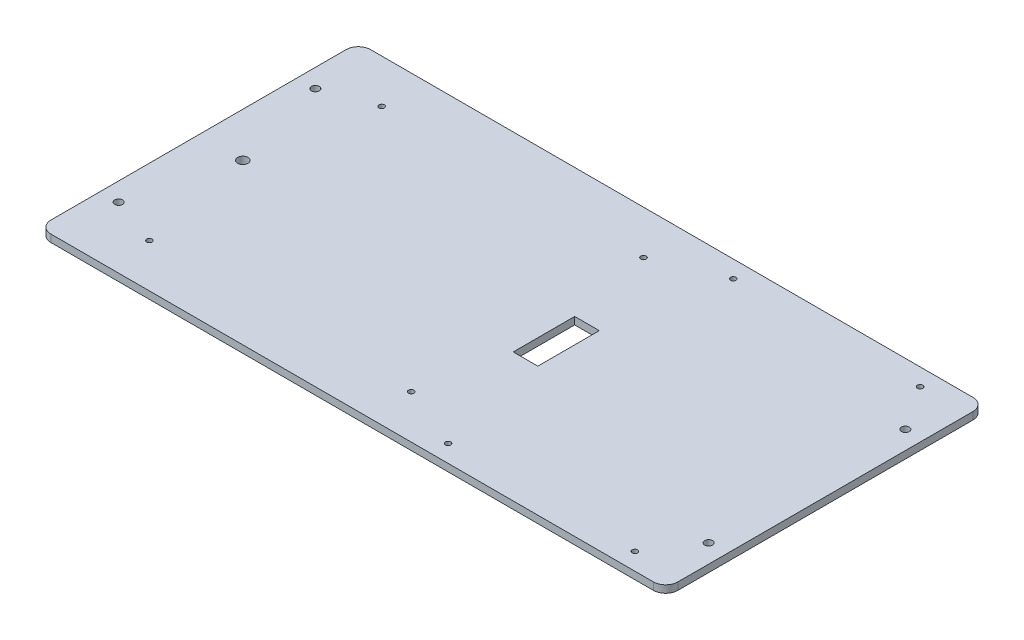
ISO-10303-21;
HEADER;
FILE_DESCRIPTION(('STEP AP214'),'2;1');
FILE_NAME('part.step','',(''),(''),'','','');
FILE_SCHEMA(('AUTOMOTIVE_DESIGN { 1 0 10303 214 1 1 1 1 }'));
ENDSEC;
DATA;
#1=APPLICATION_CONTEXT('core data for automotive mechanical design processes');
#2=APPLICATION_PROTOCOL_DEFINITION('international standard','automotive_design',2000,#1);
#3=PRODUCT_CONTEXT('',#1,'mechanical');
#4=PRODUCT('Part','Part','',(#3));
#5=PRODUCT_RELATED_PRODUCT_CATEGORY('part','',(#4));
#6=PRODUCT_DEFINITION_FORMATION('','',#4);
#7=PRODUCT_DEFINITION_CONTEXT('part definition',#1,'design');
#8=PRODUCT_DEFINITION('design','',#6,#7);
#9=PRODUCT_DEFINITION_SHAPE('','',#8);
#10=(LENGTH_UNIT() NAMED_UNIT(*) SI_UNIT(.MILLI.,.METRE.));
#11=(NAMED_UNIT(*) PLANE_ANGLE_UNIT() SI_UNIT($,.RADIAN.));
#12=(NAMED_UNIT(*) SI_UNIT($,.STERADIAN.) SOLID_ANGLE_UNIT());
#13=UNCERTAINTY_MEASURE_WITH_UNIT(LENGTH_MEASURE(1.E-05),#10,'distance_accuracy_value','');
#14=(GEOMETRIC_REPRESENTATION_CONTEXT(3) GLOBAL_UNCERTAINTY_ASSIGNED_CONTEXT((#13)) GLOBAL_UNIT_ASSIGNED_CONTEXT((#10,
#11,#12)) REPRESENTATION_CONTEXT('',''));
#15=CARTESIAN_POINT('',(0.,0.,0.));
#16=DIRECTION('',(0.,0.,1.));
#17=DIRECTION('',(1.,0.,0.));
#18=AXIS2_PLACEMENT_3D('',#15,#16,#17);
#19=CARTESIAN_POINT('',(0.,3.,0.));
#20=DIRECTION('',(0.,-1.,0.));
#21=DIRECTION('',(0.,0.,-1.));
#22=AXIS2_PLACEMENT_3D('',#19,#20,#21);
#23=PLANE('',#22);
#24=CARTESIAN_POINT('',(-120.,3.,-39.9999999999999));
#25=DIRECTION('',(0.,1.,0.));
#26=DIRECTION('',(0.,0.,1.));
#27=AXIS2_PLACEMENT_3D('',#24,#25,#26);
#28=CIRCLE('',#27,1.60000000000001);
#29=CARTESIAN_POINT('',(-120.,3.,-38.3999999999999));
#30=VERTEX_POINT('',#29);
#31=EDGE_CURVE('E166',#30,#30,#28,.T.);
#32=ORIENTED_EDGE('',*,*,#31,.F.);
#33=EDGE_LOOP('',(#32));
#34=FACE_BOUND('',#33,.T.);
#35=CARTESIAN_POINT('',(120.,3.,-40.));
#36=DIRECTION('',(0.,1.,0.));
#37=DIRECTION('',(0.,0.,-1.));
#38=AXIS2_PLACEMENT_3D('',#35,#36,#37);
#39=CIRCLE('',#38,1.60000000000001);
#40=CARTESIAN_POINT('',(120.,3.,-41.6));
#41=VERTEX_POINT('',#40);
#42=EDGE_CURVE('E172',#41,#41,#39,.T.);
#43=ORIENTED_EDGE('',*,*,#42,.F.);
#44=EDGE_LOOP('',(#43));
#45=FACE_BOUND('',#44,.T.);
#46=CARTESIAN_POINT('',(-120.,3.,40.));
#47=DIRECTION('',(0.,1.,0.));
#48=DIRECTION('',(0.,0.,-1.));
#49=AXIS2_PLACEMENT_3D('',#46,#47,#48);
#50=CIRCLE('',#49,1.60000000000001);
#51=CARTESIAN_POINT('',(-120.,3.,38.4));
#52=VERTEX_POINT('',#51);
#53=EDGE_CURVE('E178',#52,#52,#50,.T.);
#54=ORIENTED_EDGE('',*,*,#53,.F.);
#55=EDGE_LOOP('',(#54));
#56=FACE_BOUND('',#55,.T.);
#57=CARTESIAN_POINT('',(-100.25,3.,-47.25));
#58=DIRECTION('',(0.,1.,0.));
#59=DIRECTION('',(0.,0.,1.));
#60=AXIS2_PLACEMENT_3D('',#57,#58,#59);
#61=CIRCLE('',#60,1.10000000000001);
#62=CARTESIAN_POINT('',(-100.25,3.,-46.15));
#63=VERTEX_POINT('',#62);
#64=EDGE_CURVE('E184',#63,#63,#61,.T.);
#65=ORIENTED_EDGE('',*,*,#64,.F.);
#66=EDGE_LOOP('',(#65));
#67=FACE_BOUND('',#66,.T.);
#68=CARTESIAN_POINT('',(120.,3.,40.));
#69=DIRECTION('',(0.,1.,0.));
#70=DIRECTION('',(0.,0.,1.));
#71=AXIS2_PLACEMENT_3D('',#68,#69,#70);
#72=CIRCLE('',#71,1.60000000000001);
#73=CARTESIAN_POINT('',(120.,3.,41.6));
#74=VERTEX_POINT('',#73);
#75=EDGE_CURVE('E190',#74,#74,#72,.T.);
#76=ORIENTED_EDGE('',*,*,#75,.F.);
#77=EDGE_LOOP('',(#76));
#78=FACE_BOUND('',#77,.T.);
#79=DIRECTION('',(-1.,0.,0.));
#80=VECTOR('',#79,1.);
#81=CARTESIAN_POINT('',(-127.5,3.,-65.));
#82=LINE('',#81,#80);
#83=CARTESIAN_POINT('',(122.5,3.,-65.));
#84=VERTEX_POINT('',#83);
#85=CARTESIAN_POINT('',(-122.5,3.,-65.));
#86=VERTEX_POINT('',#85);
#87=EDGE_CURVE('E199',#84,#86,#82,.T.);
#88=ORIENTED_EDGE('',*,*,#87,.T.);
#89=CARTESIAN_POINT('',(-122.5,3.,-60.));
#90=DIRECTION('',(0.,-1.,0.));
#91=DIRECTION('',(0.,0.,-1.));
#92=AXIS2_PLACEMENT_3D('',#89,#90,#91);
#93=CIRCLE('',#92,5.);
#94=CARTESIAN_POINT('',(-127.5,3.,-60.));
#95=VERTEX_POINT('',#94);
#96=EDGE_CURVE('E239',#86,#95,#93,.F.);
#97=ORIENTED_EDGE('',*,*,#96,.T.);
#98=DIRECTION('',(0.,0.,1.));
#99=VECTOR('',#98,1.);
#100=CARTESIAN_POINT('',(-127.5,3.,65.));
#101=LINE('',#100,#99);
#102=CARTESIAN_POINT('',(-127.5,3.,60.));
#103=VERTEX_POINT('',#102);
#104=EDGE_CURVE('E203',#95,#103,#101,.T.);
#105=ORIENTED_EDGE('',*,*,#104,.T.);
#106=CARTESIAN_POINT('',(-122.5,3.,60.));
#107=DIRECTION('',(0.,-1.,0.));
#108=DIRECTION('',(0.,0.,-1.));
#109=AXIS2_PLACEMENT_3D('',#106,#107,#108);
#110=CIRCLE('',#109,5.);
#111=CARTESIAN_POINT('',(-122.5,3.,65.));
#112=VERTEX_POINT('',#111);
#113=EDGE_CURVE('E52',#103,#112,#110,.F.);
#114=ORIENTED_EDGE('',*,*,#113,.T.);
#115=DIRECTION('',(1.,0.,0.));
#116=VECTOR('',#115,1.);
#117=CARTESIAN_POINT('',(-127.5,3.,65.));
#118=LINE('',#117,#116);
#119=CARTESIAN_POINT('',(122.5,3.,65.));
#120=VERTEX_POINT('',#119);
#121=EDGE_CURVE('E205',#112,#120,#118,.T.);
#122=ORIENTED_EDGE('',*,*,#121,.T.);
#123=CARTESIAN_POINT('',(122.5,3.,60.));
#124=DIRECTION('',(0.,-1.,0.));
#125=DIRECTION('',(0.,0.,-1.));
#126=AXIS2_PLACEMENT_3D('',#123,#124,#125);
#127=CIRCLE('',#126,5.);
#128=CARTESIAN_POINT('',(127.5,3.,60.));
#129=VERTEX_POINT('',#128);
#130=EDGE_CURVE('E235',#120,#129,#127,.F.);
#131=ORIENTED_EDGE('',*,*,#130,.T.);
#132=DIRECTION('',(0.,0.,-1.));
#133=VECTOR('',#132,1.);
#134=CARTESIAN_POINT('',(127.5,3.,65.));
#135=LINE('',#134,#133);
#136=CARTESIAN_POINT('',(127.5,3.,-60.));
#137=VERTEX_POINT('',#136);
#138=EDGE_CURVE('E196',#129,#137,#135,.T.);
#139=ORIENTED_EDGE('',*,*,#138,.T.);
#140=CARTESIAN_POINT('',(122.5,3.,-60.));
#141=DIRECTION('',(0.,-1.,0.));
#142=DIRECTION('',(0.,0.,-1.));
#143=AXIS2_PLACEMENT_3D('',#140,#141,#142);
#144=CIRCLE('',#143,5.);
#145=EDGE_CURVE('E237',#137,#84,#144,.F.);
#146=ORIENTED_EDGE('',*,*,#145,.T.);
#147=EDGE_LOOP('',(#88,#97,#105,#114,#122,#131,#139,#146));
#148=FACE_BOUND('',#147,.T.);
#149=DIRECTION('',(0.,0.,-1.));
#150=VECTOR('',#149,1.);
#151=CARTESIAN_POINT('',(23.,3.,12.5));
#152=LINE('',#151,#150);
#153=CARTESIAN_POINT('',(23.,3.,12.5));
#154=VERTEX_POINT('',#153);
#155=CARTESIAN_POINT('',(23.,3.,-12.5));
#156=VERTEX_POINT('',#155);
#157=EDGE_CURVE('E122',#154,#156,#152,.T.);
#158=ORIENTED_EDGE('',*,*,#157,.F.);
#159=DIRECTION('',(1.,0.,0.));
#160=VECTOR('',#159,1.);
#161=CARTESIAN_POINT('',(13.,3.,12.5));
#162=LINE('',#161,#160);
#163=CARTESIAN_POINT('',(13.,3.,12.5));
#164=VERTEX_POINT('',#163);
#165=EDGE_CURVE('E148',#164,#154,#162,.T.);
#166=ORIENTED_EDGE('',*,*,#165,.F.);
#167=DIRECTION('',(0.,0.,1.));
#168=VECTOR('',#167,1.);
#169=CARTESIAN_POINT('',(13.,3.,12.5));
#170=LINE('',#169,#168);
#171=CARTESIAN_POINT('',(13.,3.,-12.5));
#172=VERTEX_POINT('',#171);
#173=EDGE_CURVE('E146',#172,#164,#170,.T.);
#174=ORIENTED_EDGE('',*,*,#173,.F.);
#175=DIRECTION('',(-1.,0.,0.));
#176=VECTOR('',#175,1.);
#177=CARTESIAN_POINT('',(13.,3.,-12.5));
#178=LINE('',#177,#176);
#179=EDGE_CURVE('E132',#156,#172,#178,.T.);
#180=ORIENTED_EDGE('',*,*,#179,.F.);
#181=EDGE_LOOP('',(#158,#166,#174,#180));
#182=FACE_BOUND('',#181,.T.);
#183=CARTESIAN_POINT('',(32.,3.,58.));
#184=DIRECTION('',(0.,1.,0.));
#185=DIRECTION('',(0.,0.,1.));
#186=AXIS2_PLACEMENT_3D('',#183,#184,#185);
#187=CIRCLE('',#186,1.09999999999999);
#188=CARTESIAN_POINT('',(32.,3.,59.1));
#189=VERTEX_POINT('',#188);
#190=EDGE_CURVE('E155',#189,#189,#187,.T.);
#191=ORIENTED_EDGE('',*,*,#190,.F.);
#192=EDGE_LOOP('',(#191));
#193=FACE_BOUND('',#192,.T.);
#194=CARTESIAN_POINT('',(108.,3.,58.));
#195=DIRECTION('',(0.,1.,0.));
#196=DIRECTION('',(0.,0.,1.));
#197=AXIS2_PLACEMENT_3D('',#194,#195,#196);
#198=CIRCLE('',#197,1.10000000000001);
#199=CARTESIAN_POINT('',(108.,3.,59.1));
#200=VERTEX_POINT('',#199);
#201=EDGE_CURVE('E585',#200,#200,#198,.T.);
#202=ORIENTED_EDGE('',*,*,#201,.F.);
#203=EDGE_LOOP('',(#202));
#204=FACE_BOUND('',#203,.T.);
#205=CARTESIAN_POINT('',(108.,3.,-58.));
#206=DIRECTION('',(0.,1.,0.));
#207=DIRECTION('',(0.,0.,1.));
#208=AXIS2_PLACEMENT_3D('',#205,#206,#207);
#209=CIRCLE('',#208,1.10000000000001);
#210=CARTESIAN_POINT('',(108.,3.,-56.9));
#211=VERTEX_POINT('',#210);
#212=EDGE_CURVE('E580',#211,#211,#209,.T.);
#213=ORIENTED_EDGE('',*,*,#212,.F.);
#214=EDGE_LOOP('',(#213));
#215=FACE_BOUND('',#214,.T.);
#216=CARTESIAN_POINT('',(32.,3.,-58.));
#217=DIRECTION('',(0.,1.,0.));
#218=DIRECTION('',(0.,0.,1.));
#219=AXIS2_PLACEMENT_3D('',#216,#217,#218);
#220=CIRCLE('',#219,1.09999999999999);
#221=CARTESIAN_POINT('',(32.,3.,-56.9));
#222=VERTEX_POINT('',#221);
#223=EDGE_CURVE('E575',#222,#222,#220,.T.);
#224=ORIENTED_EDGE('',*,*,#223,.F.);
#225=EDGE_LOOP('',(#224));
#226=FACE_BOUND('',#225,.T.);
#227=CARTESIAN_POINT('',(6.24999999999997,3.,-47.25));
#228=DIRECTION('',(0.,1.,0.));
#229=DIRECTION('',(0.,0.,1.));
#230=AXIS2_PLACEMENT_3D('',#227,#228,#229);
#231=CIRCLE('',#230,1.09999999999999);
#232=CARTESIAN_POINT('',(6.24999999999997,3.,-46.15));
#233=VERTEX_POINT('',#232);
#234=EDGE_CURVE('E570',#233,#233,#231,.T.);
#235=ORIENTED_EDGE('',*,*,#234,.F.);
#236=EDGE_LOOP('',(#235));
#237=FACE_BOUND('',#236,.T.);
#238=CARTESIAN_POINT('',(-100.25,3.,47.25));
#239=DIRECTION('',(0.,1.,0.));
#240=DIRECTION('',(0.,0.,1.));
#241=AXIS2_PLACEMENT_3D('',#238,#239,#240);
#242=CIRCLE('',#241,1.10000000000001);
#243=CARTESIAN_POINT('',(-100.25,3.,48.35));
#244=VERTEX_POINT('',#243);
#245=EDGE_CURVE('E565',#244,#244,#242,.T.);
#246=ORIENTED_EDGE('',*,*,#245,.F.);
#247=EDGE_LOOP('',(#246));
#248=FACE_BOUND('',#247,.T.);
#249=CARTESIAN_POINT('',(6.24999999999997,3.,47.25));
#250=DIRECTION('',(0.,1.,0.));
#251=DIRECTION('',(0.,0.,1.));
#252=AXIS2_PLACEMENT_3D('',#249,#250,#251);
#253=CIRCLE('',#252,1.09999999999999);
#254=CARTESIAN_POINT('',(6.24999999999997,3.,48.35));
#255=VERTEX_POINT('',#254);
#256=EDGE_CURVE('E560',#255,#255,#253,.T.);
#257=ORIENTED_EDGE('',*,*,#256,.F.);
#258=EDGE_LOOP('',(#257));
#259=FACE_BOUND('',#258,.T.);
#260=CARTESIAN_POINT('',(-109.5,3.,0.));
#261=DIRECTION('',(0.,1.,0.));
#262=DIRECTION('',(0.,0.,1.));
#263=AXIS2_PLACEMENT_3D('',#260,#261,#262);
#264=CIRCLE('',#263,2.1);
#265=CARTESIAN_POINT('',(-109.5,3.,2.10000000000003));
#266=VERTEX_POINT('',#265);
#267=EDGE_CURVE('E554',#266,#266,#264,.T.);
#268=ORIENTED_EDGE('',*,*,#267,.F.);
#269=EDGE_LOOP('',(#268));
#270=FACE_BOUND('',#269,.T.);
#271=ADVANCED_FACE('F32',(#34,#45,#56,#67,#78,#148,#182,#193,#204,#215,#226,#237,#248,#259,
#270),#23,.F.);
#272=CARTESIAN_POINT('',(0.,0.,0.));
#273=DIRECTION('',(0.,-1.,0.));
#274=DIRECTION('',(0.,0.,-1.));
#275=AXIS2_PLACEMENT_3D('',#272,#273,#274);
#276=PLANE('',#275);
#277=CARTESIAN_POINT('',(6.24999999999997,0.,47.25));
#278=DIRECTION('',(0.,1.,0.));
#279=DIRECTION('',(0.,0.,1.));
#280=AXIS2_PLACEMENT_3D('',#277,#278,#279);
#281=CIRCLE('',#280,1.09999999999999);
#282=CARTESIAN_POINT('',(6.24999999999997,0.,48.35));
#283=VERTEX_POINT('',#282);
#284=EDGE_CURVE('E557',#283,#283,#281,.T.);
#285=ORIENTED_EDGE('',*,*,#284,.T.);
#286=EDGE_LOOP('',(#285));
#287=FACE_BOUND('',#286,.T.);
#288=CARTESIAN_POINT('',(6.24999999999997,0.,-47.25));
#289=DIRECTION('',(0.,1.,0.));
#290=DIRECTION('',(0.,0.,1.));
#291=AXIS2_PLACEMENT_3D('',#288,#289,#290);
#292=CIRCLE('',#291,1.09999999999999);
#293=CARTESIAN_POINT('',(6.24999999999997,0.,-46.15));
#294=VERTEX_POINT('',#293);
#295=EDGE_CURVE('E568',#294,#294,#292,.T.);
#296=ORIENTED_EDGE('',*,*,#295,.T.);
#297=EDGE_LOOP('',(#296));
#298=FACE_BOUND('',#297,.T.);
#299=CARTESIAN_POINT('',(108.,0.,-58.));
#300=DIRECTION('',(0.,1.,0.));
#301=DIRECTION('',(0.,0.,1.));
#302=AXIS2_PLACEMENT_3D('',#299,#300,#301);
#303=CIRCLE('',#302,1.10000000000001);
#304=CARTESIAN_POINT('',(108.,0.,-56.9));
#305=VERTEX_POINT('',#304);
#306=EDGE_CURVE('E578',#305,#305,#303,.T.);
#307=ORIENTED_EDGE('',*,*,#306,.T.);
#308=EDGE_LOOP('',(#307));
#309=FACE_BOUND('',#308,.T.);
#310=CARTESIAN_POINT('',(32.,0.,58.));
#311=DIRECTION('',(0.,1.,0.));
#312=DIRECTION('',(0.,0.,1.));
#313=AXIS2_PLACEMENT_3D('',#310,#311,#312);
#314=CIRCLE('',#313,1.09999999999999);
#315=CARTESIAN_POINT('',(32.,0.,59.1));
#316=VERTEX_POINT('',#315);
#317=EDGE_CURVE('E588',#316,#316,#314,.T.);
#318=ORIENTED_EDGE('',*,*,#317,.T.);
#319=EDGE_LOOP('',(#318));
#320=FACE_BOUND('',#319,.T.);
#321=CARTESIAN_POINT('',(120.,0.,-40.));
#322=DIRECTION('',(0.,1.,0.));
#323=DIRECTION('',(0.,0.,-1.));
#324=AXIS2_PLACEMENT_3D('',#321,#322,#323);
#325=CIRCLE('',#324,1.60000000000001);
#326=CARTESIAN_POINT('',(120.,0.,-41.6));
#327=VERTEX_POINT('',#326);
#328=EDGE_CURVE('E169',#327,#327,#325,.T.);
#329=ORIENTED_EDGE('',*,*,#328,.T.);
#330=EDGE_LOOP('',(#329));
#331=FACE_BOUND('',#330,.T.);
#332=CARTESIAN_POINT('',(-100.25,0.,-47.25));
#333=DIRECTION('',(0.,1.,0.));
#334=DIRECTION('',(0.,0.,1.));
#335=AXIS2_PLACEMENT_3D('',#332,#333,#334);
#336=CIRCLE('',#335,1.10000000000001);
#337=CARTESIAN_POINT('',(-100.25,0.,-46.15));
#338=VERTEX_POINT('',#337);
#339=EDGE_CURVE('E181',#338,#338,#336,.T.);
#340=ORIENTED_EDGE('',*,*,#339,.T.);
#341=EDGE_LOOP('',(#340));
#342=FACE_BOUND('',#341,.T.);
#343=DIRECTION('',(0.,0.,1.));
#344=VECTOR('',#343,1.);
#345=CARTESIAN_POINT('',(-127.5,0.,65.));
#346=LINE('',#345,#344);
#347=CARTESIAN_POINT('',(-127.5,0.,-60.));
#348=VERTEX_POINT('',#347);
#349=CARTESIAN_POINT('',(-127.5,0.,60.));
#350=VERTEX_POINT('',#349);
#351=EDGE_CURVE('E213',#348,#350,#346,.T.);
#352=ORIENTED_EDGE('',*,*,#351,.F.);
#353=CARTESIAN_POINT('',(-122.5,0.,-60.));
#354=DIRECTION('',(0.,-1.,0.));
#355=DIRECTION('',(0.,0.,-1.));
#356=AXIS2_PLACEMENT_3D('',#353,#354,#355);
#357=CIRCLE('',#356,5.);
#358=CARTESIAN_POINT('',(-122.5,0.,-65.));
#359=VERTEX_POINT('',#358);
#360=EDGE_CURVE('E227',#348,#359,#357,.T.);
#361=ORIENTED_EDGE('',*,*,#360,.T.);
#362=DIRECTION('',(-1.,0.,0.));
#363=VECTOR('',#362,1.);
#364=CARTESIAN_POINT('',(-127.5,0.,-65.));
#365=LINE('',#364,#363);
#366=CARTESIAN_POINT('',(122.5,0.,-65.));
#367=VERTEX_POINT('',#366);
#368=EDGE_CURVE('E210',#367,#359,#365,.T.);
#369=ORIENTED_EDGE('',*,*,#368,.F.);
#370=CARTESIAN_POINT('',(122.5,0.,-60.));
#371=DIRECTION('',(0.,-1.,0.));
#372=DIRECTION('',(0.,0.,-1.));
#373=AXIS2_PLACEMENT_3D('',#370,#371,#372);
#374=CIRCLE('',#373,5.);
#375=CARTESIAN_POINT('',(127.5,0.,-60.));
#376=VERTEX_POINT('',#375);
#377=EDGE_CURVE('E225',#367,#376,#374,.T.);
#378=ORIENTED_EDGE('',*,*,#377,.T.);
#379=DIRECTION('',(0.,0.,-1.));
#380=VECTOR('',#379,1.);
#381=CARTESIAN_POINT('',(127.5,0.,65.));
#382=LINE('',#381,#380);
#383=CARTESIAN_POINT('',(127.5,0.,60.));
#384=VERTEX_POINT('',#383);
#385=EDGE_CURVE('E193',#384,#376,#382,.T.);
#386=ORIENTED_EDGE('',*,*,#385,.F.);
#387=CARTESIAN_POINT('',(122.5,0.,60.));
#388=DIRECTION('',(0.,-1.,0.));
#389=DIRECTION('',(0.,0.,-1.));
#390=AXIS2_PLACEMENT_3D('',#387,#388,#389);
#391=CIRCLE('',#390,5.);
#392=CARTESIAN_POINT('',(122.5,0.,65.));
#393=VERTEX_POINT('',#392);
#394=EDGE_CURVE('E223',#384,#393,#391,.T.);
#395=ORIENTED_EDGE('',*,*,#394,.T.);
#396=DIRECTION('',(1.,0.,0.));
#397=VECTOR('',#396,1.);
#398=CARTESIAN_POINT('',(-127.5,0.,65.));
#399=LINE('',#398,#397);
#400=CARTESIAN_POINT('',(-122.5,0.,65.));
#401=VERTEX_POINT('',#400);
#402=EDGE_CURVE('E200',#401,#393,#399,.T.);
#403=ORIENTED_EDGE('',*,*,#402,.F.);
#404=CARTESIAN_POINT('',(-122.5,0.,60.));
#405=DIRECTION('',(0.,-1.,0.));
#406=DIRECTION('',(0.,0.,-1.));
#407=AXIS2_PLACEMENT_3D('',#404,#405,#406);
#408=CIRCLE('',#407,5.);
#409=EDGE_CURVE('E221',#401,#350,#408,.T.);
#410=ORIENTED_EDGE('',*,*,#409,.T.);
#411=EDGE_LOOP('',(#352,#361,#369,#378,#386,#395,#403,#410));
#412=FACE_BOUND('',#411,.T.);
#413=CARTESIAN_POINT('',(120.,0.,40.));
#414=DIRECTION('',(0.,1.,0.));
#415=DIRECTION('',(0.,0.,1.));
#416=AXIS2_PLACEMENT_3D('',#413,#414,#415);
#417=CIRCLE('',#416,1.60000000000001);
#418=CARTESIAN_POINT('',(120.,0.,41.6));
#419=VERTEX_POINT('',#418);
#420=EDGE_CURVE('E187',#419,#419,#417,.T.);
#421=ORIENTED_EDGE('',*,*,#420,.T.);
#422=EDGE_LOOP('',(#421));
#423=FACE_BOUND('',#422,.T.);
#424=CARTESIAN_POINT('',(-120.,0.,40.));
#425=DIRECTION('',(0.,1.,0.));
#426=DIRECTION('',(0.,0.,-1.));
#427=AXIS2_PLACEMENT_3D('',#424,#425,#426);
#428=CIRCLE('',#427,1.60000000000001);
#429=CARTESIAN_POINT('',(-120.,0.,38.4));
#430=VERTEX_POINT('',#429);
#431=EDGE_CURVE('E175',#430,#430,#428,.T.);
#432=ORIENTED_EDGE('',*,*,#431,.T.);
#433=EDGE_LOOP('',(#432));
#434=FACE_BOUND('',#433,.T.);
#435=CARTESIAN_POINT('',(-120.,0.,-39.9999999999999));
#436=DIRECTION('',(0.,1.,0.));
#437=DIRECTION('',(0.,0.,1.));
#438=AXIS2_PLACEMENT_3D('',#435,#436,#437);
#439=CIRCLE('',#438,1.60000000000001);
#440=CARTESIAN_POINT('',(-120.,0.,-38.3999999999999));
#441=VERTEX_POINT('',#440);
#442=EDGE_CURVE('E140',#441,#441,#439,.T.);
#443=ORIENTED_EDGE('',*,*,#442,.T.);
#444=EDGE_LOOP('',(#443));
#445=FACE_BOUND('',#444,.T.);
#446=DIRECTION('',(1.,0.,0.));
#447=VECTOR('',#446,1.);
#448=CARTESIAN_POINT('',(13.,0.,12.5));
#449=LINE('',#448,#447);
#450=CARTESIAN_POINT('',(13.,0.,12.5));
#451=VERTEX_POINT('',#450);
#452=CARTESIAN_POINT('',(23.,0.,12.5));
#453=VERTEX_POINT('',#452);
#454=EDGE_CURVE('E133',#451,#453,#449,.T.);
#455=ORIENTED_EDGE('',*,*,#454,.T.);
#456=DIRECTION('',(0.,0.,-1.));
#457=VECTOR('',#456,1.);
#458=CARTESIAN_POINT('',(23.,0.,12.5));
#459=LINE('',#458,#457);
#460=CARTESIAN_POINT('',(23.,0.,-12.5));
#461=VERTEX_POINT('',#460);
#462=EDGE_CURVE('E153',#453,#461,#459,.T.);
#463=ORIENTED_EDGE('',*,*,#462,.T.);
#464=DIRECTION('',(-1.,0.,0.));
#465=VECTOR('',#464,1.);
#466=CARTESIAN_POINT('',(13.,0.,-12.5));
#467=LINE('',#466,#465);
#468=CARTESIAN_POINT('',(13.,0.,-12.5));
#469=VERTEX_POINT('',#468);
#470=EDGE_CURVE('E139',#461,#469,#467,.T.);
#471=ORIENTED_EDGE('',*,*,#470,.T.);
#472=DIRECTION('',(0.,0.,1.));
#473=VECTOR('',#472,1.);
#474=CARTESIAN_POINT('',(13.,0.,12.5));
#475=LINE('',#474,#473);
#476=EDGE_CURVE('E157',#469,#451,#475,.T.);
#477=ORIENTED_EDGE('',*,*,#476,.T.);
#478=EDGE_LOOP('',(#455,#463,#471,#477));
#479=FACE_BOUND('',#478,.T.);
#480=CARTESIAN_POINT('',(108.,0.,58.));
#481=DIRECTION('',(0.,1.,0.));
#482=DIRECTION('',(0.,0.,1.));
#483=AXIS2_PLACEMENT_3D('',#480,#481,#482);
#484=CIRCLE('',#483,1.10000000000001);
#485=CARTESIAN_POINT('',(108.,0.,59.1));
#486=VERTEX_POINT('',#485);
#487=EDGE_CURVE('E541',#486,#486,#484,.T.);
#488=ORIENTED_EDGE('',*,*,#487,.T.);
#489=EDGE_LOOP('',(#488));
#490=FACE_BOUND('',#489,.T.);
#491=CARTESIAN_POINT('',(32.,0.,-58.));
#492=DIRECTION('',(0.,1.,0.));
#493=DIRECTION('',(0.,0.,1.));
#494=AXIS2_PLACEMENT_3D('',#491,#492,#493);
#495=CIRCLE('',#494,1.09999999999999);
#496=CARTESIAN_POINT('',(32.,0.,-56.9));
#497=VERTEX_POINT('',#496);
#498=EDGE_CURVE('E545',#497,#497,#495,.T.);
#499=ORIENTED_EDGE('',*,*,#498,.T.);
#500=EDGE_LOOP('',(#499));
#501=FACE_BOUND('',#500,.T.);
#502=CARTESIAN_POINT('',(-100.25,0.,47.25));
#503=DIRECTION('',(0.,1.,0.));
#504=DIRECTION('',(0.,0.,1.));
#505=AXIS2_PLACEMENT_3D('',#502,#503,#504);
#506=CIRCLE('',#505,1.10000000000001);
#507=CARTESIAN_POINT('',(-100.25,0.,48.35));
#508=VERTEX_POINT('',#507);
#509=EDGE_CURVE('E549',#508,#508,#506,.T.);
#510=ORIENTED_EDGE('',*,*,#509,.T.);
#511=EDGE_LOOP('',(#510));
#512=FACE_BOUND('',#511,.T.);
#513=CARTESIAN_POINT('',(-109.5,0.,0.));
#514=DIRECTION('',(0.,1.,0.));
#515=DIRECTION('',(0.,0.,1.));
#516=AXIS2_PLACEMENT_3D('',#513,#514,#515);
#517=CIRCLE('',#516,2.1);
#518=CARTESIAN_POINT('',(-109.5,0.,2.10000000000003));
#519=VERTEX_POINT('',#518);
#520=EDGE_CURVE('E552',#519,#519,#517,.T.);
#521=ORIENTED_EDGE('',*,*,#520,.T.);
#522=EDGE_LOOP('',(#521));
#523=FACE_BOUND('',#522,.T.);
#524=ADVANCED_FACE('F252',(#287,#298,#309,#320,#331,#342,#412,#423,#434,#445,#479,#490,#501,
#512,#523),#276,.T.);
#525=CARTESIAN_POINT('',(127.5,3.,65.));
#526=DIRECTION('',(-1.,0.,0.));
#527=DIRECTION('',(0.,0.,1.));
#528=AXIS2_PLACEMENT_3D('',#525,#526,#527);
#529=PLANE('',#528);
#530=ORIENTED_EDGE('',*,*,#385,.T.);
#531=DIRECTION('',(0.,-1.,0.));
#532=VECTOR('',#531,1.);
#533=CARTESIAN_POINT('',(127.5,3.,-60.));
#534=LINE('',#533,#532);
#535=EDGE_CURVE('E244',#376,#137,#534,.F.);
#536=ORIENTED_EDGE('',*,*,#535,.T.);
#537=ORIENTED_EDGE('',*,*,#138,.F.);
#538=DIRECTION('',(0.,-1.,0.));
#539=VECTOR('',#538,1.);
#540=CARTESIAN_POINT('',(127.5,3.,60.));
#541=LINE('',#540,#539);
#542=EDGE_CURVE('E241',#129,#384,#541,.T.);
#543=ORIENTED_EDGE('',*,*,#542,.T.);
#544=EDGE_LOOP('',(#530,#536,#537,#543));
#545=FACE_BOUND('',#544,.T.);
#546=ADVANCED_FACE('F261',(#545),#529,.F.);
#547=CARTESIAN_POINT('',(-127.5,3.,-65.));
#548=DIRECTION('',(0.,0.,1.));
#549=DIRECTION('',(1.,0.,0.));
#550=AXIS2_PLACEMENT_3D('',#547,#548,#549);
#551=PLANE('',#550);
#552=ORIENTED_EDGE('',*,*,#368,.T.);
#553=DIRECTION('',(0.,-1.,0.));
#554=VECTOR('',#553,1.);
#555=CARTESIAN_POINT('',(-122.5,3.,-65.));
#556=LINE('',#555,#554);
#557=EDGE_CURVE('E232',#359,#86,#556,.F.);
#558=ORIENTED_EDGE('',*,*,#557,.T.);
#559=ORIENTED_EDGE('',*,*,#87,.F.);
#560=DIRECTION('',(0.,-1.,0.));
#561=VECTOR('',#560,1.);
#562=CARTESIAN_POINT('',(122.5,3.,-65.));
#563=LINE('',#562,#561);
#564=EDGE_CURVE('E229',#84,#367,#563,.T.);
#565=ORIENTED_EDGE('',*,*,#564,.T.);
#566=EDGE_LOOP('',(#552,#558,#559,#565));
#567=FACE_BOUND('',#566,.T.);
#568=ADVANCED_FACE('F270',(#567),#551,.F.);
#569=CARTESIAN_POINT('',(-127.5,3.,65.));
#570=DIRECTION('',(1.,0.,0.));
#571=DIRECTION('',(0.,0.,-1.));
#572=AXIS2_PLACEMENT_3D('',#569,#570,#571);
#573=PLANE('',#572);
#574=ORIENTED_EDGE('',*,*,#104,.F.);
#575=DIRECTION('',(0.,-1.,0.));
#576=VECTOR('',#575,1.);
#577=CARTESIAN_POINT('',(-127.5,3.,-60.));
#578=LINE('',#577,#576);
#579=EDGE_CURVE('E218',#95,#348,#578,.T.);
#580=ORIENTED_EDGE('',*,*,#579,.T.);
#581=ORIENTED_EDGE('',*,*,#351,.T.);
#582=DIRECTION('',(0.,-1.,0.));
#583=VECTOR('',#582,1.);
#584=CARTESIAN_POINT('',(-127.5,3.,60.));
#585=LINE('',#584,#583);
#586=EDGE_CURVE('E207',#350,#103,#585,.F.);
#587=ORIENTED_EDGE('',*,*,#586,.T.);
#588=EDGE_LOOP('',(#574,#580,#581,#587));
#589=FACE_BOUND('',#588,.T.);
#590=ADVANCED_FACE('F278',(#589),#573,.F.);
#591=CARTESIAN_POINT('',(-127.5,3.,65.));
#592=DIRECTION('',(0.,0.,-1.));
#593=DIRECTION('',(-1.,0.,0.));
#594=AXIS2_PLACEMENT_3D('',#591,#592,#593);
#595=PLANE('',#594);
#596=ORIENTED_EDGE('',*,*,#402,.T.);
#597=DIRECTION('',(0.,-1.,0.));
#598=VECTOR('',#597,1.);
#599=CARTESIAN_POINT('',(122.5,3.,65.));
#600=LINE('',#599,#598);
#601=EDGE_CURVE('E11',#393,#120,#600,.F.);
#602=ORIENTED_EDGE('',*,*,#601,.T.);
#603=ORIENTED_EDGE('',*,*,#121,.F.);
#604=DIRECTION('',(0.,-1.,0.));
#605=VECTOR('',#604,1.);
#606=CARTESIAN_POINT('',(-122.5,3.,65.));
#607=LINE('',#606,#605);
#608=EDGE_CURVE('E40',#112,#401,#607,.T.);
#609=ORIENTED_EDGE('',*,*,#608,.T.);
#610=EDGE_LOOP('',(#596,#602,#603,#609));
#611=FACE_BOUND('',#610,.T.);
#612=ADVANCED_FACE('F248',(#611),#595,.F.);
#613=CARTESIAN_POINT('',(120.,3.,40.));
#614=DIRECTION('',(0.,-1.,0.));
#615=DIRECTION('',(0.,0.,-1.));
#616=AXIS2_PLACEMENT_3D('',#613,#614,#615);
#617=CYLINDRICAL_SURFACE('',#616,1.60000000000001);
#618=ORIENTED_EDGE('',*,*,#75,.T.);
#619=EDGE_LOOP('',(#618));
#620=FACE_BOUND('',#619,.T.);
#621=ORIENTED_EDGE('',*,*,#420,.F.);
#622=EDGE_LOOP('',(#621));
#623=FACE_BOUND('',#622,.T.);
#624=ADVANCED_FACE('F295',(#620,#623),#617,.F.);
#625=CARTESIAN_POINT('',(-100.25,3.,-47.25));
#626=DIRECTION('',(0.,-1.,0.));
#627=DIRECTION('',(0.,0.,-1.));
#628=AXIS2_PLACEMENT_3D('',#625,#626,#627);
#629=CYLINDRICAL_SURFACE('',#628,1.10000000000001);
#630=ORIENTED_EDGE('',*,*,#64,.T.);
#631=EDGE_LOOP('',(#630));
#632=FACE_BOUND('',#631,.T.);
#633=ORIENTED_EDGE('',*,*,#339,.F.);
#634=EDGE_LOOP('',(#633));
#635=FACE_BOUND('',#634,.T.);
#636=ADVANCED_FACE('F461',(#632,#635),#629,.F.);
#637=CARTESIAN_POINT('',(-120.,3.,40.));
#638=DIRECTION('',(0.,-1.,0.));
#639=DIRECTION('',(0.,0.,-1.));
#640=AXIS2_PLACEMENT_3D('',#637,#638,#639);
#641=CYLINDRICAL_SURFACE('',#640,1.60000000000001);
#642=ORIENTED_EDGE('',*,*,#53,.T.);
#643=EDGE_LOOP('',(#642));
#644=FACE_BOUND('',#643,.T.);
#645=ORIENTED_EDGE('',*,*,#431,.F.);
#646=EDGE_LOOP('',(#645));
#647=FACE_BOUND('',#646,.T.);
#648=ADVANCED_FACE('F452',(#644,#647),#641,.F.);
#649=CARTESIAN_POINT('',(120.,3.,-40.));
#650=DIRECTION('',(0.,-1.,0.));
#651=DIRECTION('',(0.,0.,-1.));
#652=AXIS2_PLACEMENT_3D('',#649,#650,#651);
#653=CYLINDRICAL_SURFACE('',#652,1.60000000000001);
#654=ORIENTED_EDGE('',*,*,#42,.T.);
#655=EDGE_LOOP('',(#654));
#656=FACE_BOUND('',#655,.T.);
#657=ORIENTED_EDGE('',*,*,#328,.F.);
#658=EDGE_LOOP('',(#657));
#659=FACE_BOUND('',#658,.T.);
#660=ADVANCED_FACE('F443',(#656,#659),#653,.F.);
#661=CARTESIAN_POINT('',(-120.,3.,-39.9999999999999));
#662=DIRECTION('',(0.,-1.,0.));
#663=DIRECTION('',(0.,0.,-1.));
#664=AXIS2_PLACEMENT_3D('',#661,#662,#663);
#665=CYLINDRICAL_SURFACE('',#664,1.60000000000001);
#666=ORIENTED_EDGE('',*,*,#31,.T.);
#667=EDGE_LOOP('',(#666));
#668=FACE_BOUND('',#667,.T.);
#669=ORIENTED_EDGE('',*,*,#442,.F.);
#670=EDGE_LOOP('',(#669));
#671=FACE_BOUND('',#670,.T.);
#672=ADVANCED_FACE('F435',(#668,#671),#665,.F.);
#673=CARTESIAN_POINT('',(23.,3.,12.5));
#674=DIRECTION('',(-1.,0.,0.));
#675=DIRECTION('',(0.,0.,1.));
#676=AXIS2_PLACEMENT_3D('',#673,#674,#675);
#677=PLANE('',#676);
#678=ORIENTED_EDGE('',*,*,#462,.F.);
#679=DIRECTION('',(0.,-1.,0.));
#680=VECTOR('',#679,1.);
#681=CARTESIAN_POINT('',(23.,3.,12.5));
#682=LINE('',#681,#680);
#683=EDGE_CURVE('E128',#154,#453,#682,.T.);
#684=ORIENTED_EDGE('',*,*,#683,.F.);
#685=ORIENTED_EDGE('',*,*,#157,.T.);
#686=DIRECTION('',(0.,-1.,0.));
#687=VECTOR('',#686,1.);
#688=CARTESIAN_POINT('',(23.,3.,-12.5));
#689=LINE('',#688,#687);
#690=EDGE_CURVE('E125',#156,#461,#689,.T.);
#691=ORIENTED_EDGE('',*,*,#690,.T.);
#692=EDGE_LOOP('',(#678,#684,#685,#691));
#693=FACE_BOUND('',#692,.T.);
#694=ADVANCED_FACE('F124',(#693),#677,.T.);
#695=CARTESIAN_POINT('',(13.,3.,-12.5));
#696=DIRECTION('',(0.,0.,1.));
#697=DIRECTION('',(1.,0.,0.));
#698=AXIS2_PLACEMENT_3D('',#695,#696,#697);
#699=PLANE('',#698);
#700=ORIENTED_EDGE('',*,*,#470,.F.);
#701=ORIENTED_EDGE('',*,*,#690,.F.);
#702=ORIENTED_EDGE('',*,*,#179,.T.);
#703=DIRECTION('',(0.,-1.,0.));
#704=VECTOR('',#703,1.);
#705=CARTESIAN_POINT('',(13.,3.,-12.5));
#706=LINE('',#705,#704);
#707=EDGE_CURVE('E141',#172,#469,#706,.T.);
#708=ORIENTED_EDGE('',*,*,#707,.T.);
#709=EDGE_LOOP('',(#700,#701,#702,#708));
#710=FACE_BOUND('',#709,.T.);
#711=ADVANCED_FACE('F136',(#710),#699,.T.);
#712=CARTESIAN_POINT('',(13.,3.,12.5));
#713=DIRECTION('',(1.,0.,0.));
#714=DIRECTION('',(0.,0.,-1.));
#715=AXIS2_PLACEMENT_3D('',#712,#713,#714);
#716=PLANE('',#715);
#717=ORIENTED_EDGE('',*,*,#476,.F.);
#718=ORIENTED_EDGE('',*,*,#707,.F.);
#719=ORIENTED_EDGE('',*,*,#173,.T.);
#720=DIRECTION('',(0.,-1.,0.));
#721=VECTOR('',#720,1.);
#722=CARTESIAN_POINT('',(13.,3.,12.5));
#723=LINE('',#722,#721);
#724=EDGE_CURVE('E163',#164,#451,#723,.T.);
#725=ORIENTED_EDGE('',*,*,#724,.T.);
#726=EDGE_LOOP('',(#717,#718,#719,#725));
#727=FACE_BOUND('',#726,.T.);
#728=ADVANCED_FACE('F411',(#727),#716,.T.);
#729=CARTESIAN_POINT('',(13.,3.,12.5));
#730=DIRECTION('',(0.,0.,-1.));
#731=DIRECTION('',(-1.,0.,0.));
#732=AXIS2_PLACEMENT_3D('',#729,#730,#731);
#733=PLANE('',#732);
#734=ORIENTED_EDGE('',*,*,#454,.F.);
#735=ORIENTED_EDGE('',*,*,#724,.F.);
#736=ORIENTED_EDGE('',*,*,#165,.T.);
#737=ORIENTED_EDGE('',*,*,#683,.T.);
#738=EDGE_LOOP('',(#734,#735,#736,#737));
#739=FACE_BOUND('',#738,.T.);
#740=ADVANCED_FACE('F402',(#739),#733,.T.);
#741=CARTESIAN_POINT('',(32.,3.,58.));
#742=DIRECTION('',(0.,-1.,0.));
#743=DIRECTION('',(0.,0.,-1.));
#744=AXIS2_PLACEMENT_3D('',#741,#742,#743);
#745=CYLINDRICAL_SURFACE('',#744,1.09999999999999);
#746=ORIENTED_EDGE('',*,*,#190,.T.);
#747=EDGE_LOOP('',(#746));
#748=FACE_BOUND('',#747,.T.);
#749=ORIENTED_EDGE('',*,*,#317,.F.);
#750=EDGE_LOOP('',(#749));
#751=FACE_BOUND('',#750,.T.);
#752=ADVANCED_FACE('F393',(#748,#751),#745,.F.);
#753=CARTESIAN_POINT('',(108.,3.,58.));
#754=DIRECTION('',(0.,-1.,0.));
#755=DIRECTION('',(0.,0.,-1.));
#756=AXIS2_PLACEMENT_3D('',#753,#754,#755);
#757=CYLINDRICAL_SURFACE('',#756,1.10000000000001);
#758=ORIENTED_EDGE('',*,*,#201,.T.);
#759=EDGE_LOOP('',(#758));
#760=FACE_BOUND('',#759,.T.);
#761=ORIENTED_EDGE('',*,*,#487,.F.);
#762=EDGE_LOOP('',(#761));
#763=FACE_BOUND('',#762,.T.);
#764=ADVANCED_FACE('F384',(#760,#763),#757,.F.);
#765=CARTESIAN_POINT('',(108.,3.,-58.));
#766=DIRECTION('',(0.,-1.,0.));
#767=DIRECTION('',(0.,0.,-1.));
#768=AXIS2_PLACEMENT_3D('',#765,#766,#767);
#769=CYLINDRICAL_SURFACE('',#768,1.10000000000001);
#770=ORIENTED_EDGE('',*,*,#212,.T.);
#771=EDGE_LOOP('',(#770));
#772=FACE_BOUND('',#771,.T.);
#773=ORIENTED_EDGE('',*,*,#306,.F.);
#774=EDGE_LOOP('',(#773));
#775=FACE_BOUND('',#774,.T.);
#776=ADVANCED_FACE('F375',(#772,#775),#769,.F.);
#777=CARTESIAN_POINT('',(32.,3.,-58.));
#778=DIRECTION('',(0.,-1.,0.));
#779=DIRECTION('',(0.,0.,-1.));
#780=AXIS2_PLACEMENT_3D('',#777,#778,#779);
#781=CYLINDRICAL_SURFACE('',#780,1.09999999999999);
#782=ORIENTED_EDGE('',*,*,#223,.T.);
#783=EDGE_LOOP('',(#782));
#784=FACE_BOUND('',#783,.T.);
#785=ORIENTED_EDGE('',*,*,#498,.F.);
#786=EDGE_LOOP('',(#785));
#787=FACE_BOUND('',#786,.T.);
#788=ADVANCED_FACE('F366',(#784,#787),#781,.F.);
#789=CARTESIAN_POINT('',(6.24999999999997,3.,-47.25));
#790=DIRECTION('',(0.,-1.,0.));
#791=DIRECTION('',(0.,0.,-1.));
#792=AXIS2_PLACEMENT_3D('',#789,#790,#791);
#793=CYLINDRICAL_SURFACE('',#792,1.09999999999999);
#794=ORIENTED_EDGE('',*,*,#234,.T.);
#795=EDGE_LOOP('',(#794));
#796=FACE_BOUND('',#795,.T.);
#797=ORIENTED_EDGE('',*,*,#295,.F.);
#798=EDGE_LOOP('',(#797));
#799=FACE_BOUND('',#798,.T.);
#800=ADVANCED_FACE('F357',(#796,#799),#793,.F.);
#801=CARTESIAN_POINT('',(-100.25,3.,47.25));
#802=DIRECTION('',(0.,-1.,0.));
#803=DIRECTION('',(0.,0.,-1.));
#804=AXIS2_PLACEMENT_3D('',#801,#802,#803);
#805=CYLINDRICAL_SURFACE('',#804,1.10000000000001);
#806=ORIENTED_EDGE('',*,*,#245,.T.);
#807=EDGE_LOOP('',(#806));
#808=FACE_BOUND('',#807,.T.);
#809=ORIENTED_EDGE('',*,*,#509,.F.);
#810=EDGE_LOOP('',(#809));
#811=FACE_BOUND('',#810,.T.);
#812=ADVANCED_FACE('F348',(#808,#811),#805,.F.);
#813=CARTESIAN_POINT('',(6.24999999999997,3.,47.25));
#814=DIRECTION('',(0.,-1.,0.));
#815=DIRECTION('',(0.,0.,-1.));
#816=AXIS2_PLACEMENT_3D('',#813,#814,#815);
#817=CYLINDRICAL_SURFACE('',#816,1.09999999999999);
#818=ORIENTED_EDGE('',*,*,#256,.T.);
#819=EDGE_LOOP('',(#818));
#820=FACE_BOUND('',#819,.T.);
#821=ORIENTED_EDGE('',*,*,#284,.F.);
#822=EDGE_LOOP('',(#821));
#823=FACE_BOUND('',#822,.T.);
#824=ADVANCED_FACE('F339',(#820,#823),#817,.F.);
#825=CARTESIAN_POINT('',(-109.5,3.,0.));
#826=DIRECTION('',(0.,-1.,0.));
#827=DIRECTION('',(0.,0.,-1.));
#828=AXIS2_PLACEMENT_3D('',#825,#826,#827);
#829=CYLINDRICAL_SURFACE('',#828,2.1);
#830=ORIENTED_EDGE('',*,*,#267,.T.);
#831=EDGE_LOOP('',(#830));
#832=FACE_BOUND('',#831,.T.);
#833=ORIENTED_EDGE('',*,*,#520,.F.);
#834=EDGE_LOOP('',(#833));
#835=FACE_BOUND('',#834,.T.);
#836=ADVANCED_FACE('F308',(#832,#835),#829,.F.);
#837=CARTESIAN_POINT('',(-122.5,3.,-60.));
#838=DIRECTION('',(0.,-1.,0.));
#839=DIRECTION('',(0.,0.,-1.));
#840=AXIS2_PLACEMENT_3D('',#837,#838,#839);
#841=CYLINDRICAL_SURFACE('',#840,5.);
#842=ORIENTED_EDGE('',*,*,#96,.F.);
#843=ORIENTED_EDGE('',*,*,#557,.F.);
#844=ORIENTED_EDGE('',*,*,#360,.F.);
#845=ORIENTED_EDGE('',*,*,#579,.F.);
#846=EDGE_LOOP('',(#842,#843,#844,#845));
#847=FACE_BOUND('',#846,.T.);
#848=ADVANCED_FACE('F275',(#847),#841,.T.);
#849=CARTESIAN_POINT('',(122.5,3.,-60.));
#850=DIRECTION('',(0.,-1.,0.));
#851=DIRECTION('',(0.,0.,-1.));
#852=AXIS2_PLACEMENT_3D('',#849,#850,#851);
#853=CYLINDRICAL_SURFACE('',#852,5.);
#854=ORIENTED_EDGE('',*,*,#145,.F.);
#855=ORIENTED_EDGE('',*,*,#535,.F.);
#856=ORIENTED_EDGE('',*,*,#377,.F.);
#857=ORIENTED_EDGE('',*,*,#564,.F.);
#858=EDGE_LOOP('',(#854,#855,#856,#857));
#859=FACE_BOUND('',#858,.T.);
#860=ADVANCED_FACE('F267',(#859),#853,.T.);
#861=CARTESIAN_POINT('',(122.5,3.,60.));
#862=DIRECTION('',(0.,-1.,0.));
#863=DIRECTION('',(0.,0.,-1.));
#864=AXIS2_PLACEMENT_3D('',#861,#862,#863);
#865=CYLINDRICAL_SURFACE('',#864,5.);
#866=ORIENTED_EDGE('',*,*,#130,.F.);
#867=ORIENTED_EDGE('',*,*,#601,.F.);
#868=ORIENTED_EDGE('',*,*,#394,.F.);
#869=ORIENTED_EDGE('',*,*,#542,.F.);
#870=EDGE_LOOP('',(#866,#867,#868,#869));
#871=FACE_BOUND('',#870,.T.);
#872=ADVANCED_FACE('F258',(#871),#865,.T.);
#873=CARTESIAN_POINT('',(-122.5,3.,60.));
#874=DIRECTION('',(0.,-1.,0.));
#875=DIRECTION('',(0.,0.,-1.));
#876=AXIS2_PLACEMENT_3D('',#873,#874,#875);
#877=CYLINDRICAL_SURFACE('',#876,5.);
#878=ORIENTED_EDGE('',*,*,#113,.F.);
#879=ORIENTED_EDGE('',*,*,#586,.F.);
#880=ORIENTED_EDGE('',*,*,#409,.F.);
#881=ORIENTED_EDGE('',*,*,#608,.F.);
#882=EDGE_LOOP('',(#878,#879,#880,#881));
#883=FACE_BOUND('',#882,.T.);
#884=ADVANCED_FACE('F34',(#883),#877,.T.);
#885=CLOSED_SHELL('',(#271,#524,#546,#568,#590,#612,#624,#636,#648,#660,#672,#694,#711,#728,
#740,#752,#764,#776,#788,#800,#812,#824,#836,#848,#860,#872,#884));
#886=MANIFOLD_SOLID_BREP('B2',#885);
#887=ADVANCED_BREP_SHAPE_REPRESENTATION('',(#18,#886),#14);
#888=SHAPE_DEFINITION_REPRESENTATION(#9,#887);
ENDSEC;
END-ISO-10303-21;
